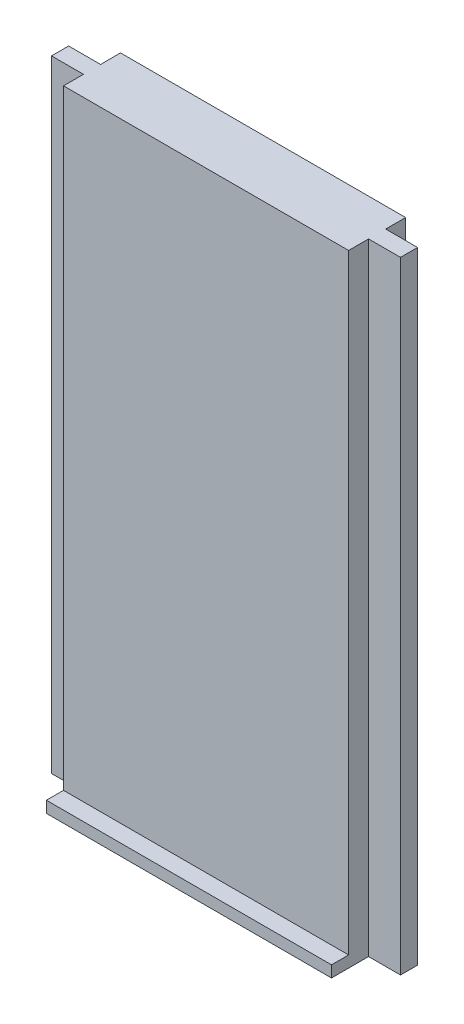
ISO-10303-21;
HEADER;
FILE_DESCRIPTION(('STEP AP214'),'2;1');
FILE_NAME('part.step','',(''),(''),'','','');
FILE_SCHEMA(('AUTOMOTIVE_DESIGN { 1 0 10303 214 1 1 1 1 }'));
ENDSEC;
DATA;
#1=APPLICATION_CONTEXT('core data for automotive mechanical design processes');
#2=APPLICATION_PROTOCOL_DEFINITION('international standard','automotive_design',2000,#1);
#3=PRODUCT_CONTEXT('',#1,'mechanical');
#4=PRODUCT('Part','Part','',(#3));
#5=PRODUCT_RELATED_PRODUCT_CATEGORY('part','',(#4));
#6=PRODUCT_DEFINITION_FORMATION('','',#4);
#7=PRODUCT_DEFINITION_CONTEXT('part definition',#1,'design');
#8=PRODUCT_DEFINITION('design','',#6,#7);
#9=PRODUCT_DEFINITION_SHAPE('','',#8);
#10=(LENGTH_UNIT() NAMED_UNIT(*) SI_UNIT(.MILLI.,.METRE.));
#11=(NAMED_UNIT(*) PLANE_ANGLE_UNIT() SI_UNIT($,.RADIAN.));
#12=(NAMED_UNIT(*) SI_UNIT($,.STERADIAN.) SOLID_ANGLE_UNIT());
#13=UNCERTAINTY_MEASURE_WITH_UNIT(LENGTH_MEASURE(1.E-05),#10,'distance_accuracy_value','');
#14=(GEOMETRIC_REPRESENTATION_CONTEXT(3) GLOBAL_UNCERTAINTY_ASSIGNED_CONTEXT((#13)) GLOBAL_UNIT_ASSIGNED_CONTEXT((#10,
#11,#12)) REPRESENTATION_CONTEXT('',''));
#15=CARTESIAN_POINT('',(0.,0.,0.));
#16=DIRECTION('',(0.,0.,1.));
#17=DIRECTION('',(1.,0.,0.));
#18=AXIS2_PLACEMENT_3D('',#15,#16,#17);
#19=CARTESIAN_POINT('',(-12.5,54.5,2.5));
#20=DIRECTION('',(0.,0.,-1.));
#21=DIRECTION('',(-1.,0.,0.));
#22=AXIS2_PLACEMENT_3D('',#19,#20,#21);
#23=PLANE('',#22);
#24=DIRECTION('',(-1.,0.,0.));
#25=VECTOR('',#24,1.);
#26=CARTESIAN_POINT('',(-12.5,1.,2.5));
#27=LINE('',#26,#25);
#28=CARTESIAN_POINT('',(12.5,1.,2.5));
#29=VERTEX_POINT('',#28);
#30=CARTESIAN_POINT('',(-12.5,1.,2.5));
#31=VERTEX_POINT('',#30);
#32=EDGE_CURVE('E50',#29,#31,#27,.T.);
#33=ORIENTED_EDGE('',*,*,#32,.F.);
#34=DIRECTION('',(0.,-1.,0.));
#35=VECTOR('',#34,1.);
#36=CARTESIAN_POINT('',(12.5,54.5,2.5));
#37=LINE('',#36,#35);
#38=CARTESIAN_POINT('',(12.5,54.5,2.5));
#39=VERTEX_POINT('',#38);
#40=EDGE_CURVE('E189',#39,#29,#37,.T.);
#41=ORIENTED_EDGE('',*,*,#40,.F.);
#42=DIRECTION('',(1.,0.,0.));
#43=VECTOR('',#42,1.);
#44=CARTESIAN_POINT('',(-12.5,54.5,2.5));
#45=LINE('',#44,#43);
#46=CARTESIAN_POINT('',(-12.5,54.5,2.5));
#47=VERTEX_POINT('',#46);
#48=EDGE_CURVE('E236',#47,#39,#45,.T.);
#49=ORIENTED_EDGE('',*,*,#48,.F.);
#50=DIRECTION('',(0.,-1.,0.));
#51=VECTOR('',#50,1.);
#52=CARTESIAN_POINT('',(-12.5,54.5,2.5));
#53=LINE('',#52,#51);
#54=EDGE_CURVE('E191',#47,#31,#53,.T.);
#55=ORIENTED_EDGE('',*,*,#54,.T.);
#56=EDGE_LOOP('',(#33,#41,#49,#55));
#57=FACE_BOUND('',#56,.T.);
#58=ADVANCED_FACE('F35',(#57),#23,.F.);
#59=CARTESIAN_POINT('',(12.5,54.5,-0.749999999999998));
#60=DIRECTION('',(-1.,0.,0.));
#61=DIRECTION('',(0.,0.,1.));
#62=AXIS2_PLACEMENT_3D('',#59,#60,#61);
#63=PLANE('',#62);
#64=DIRECTION('',(0.,0.,-1.));
#65=VECTOR('',#64,1.);
#66=CARTESIAN_POINT('',(12.5,0.,-0.749999999999998));
#67=LINE('',#66,#65);
#68=CARTESIAN_POINT('',(12.5,0.,-0.749999999999998));
#69=VERTEX_POINT('',#68);
#70=CARTESIAN_POINT('',(12.5,0.,-2.5));
#71=VERTEX_POINT('',#70);
#72=EDGE_CURVE('E162',#69,#71,#67,.T.);
#73=ORIENTED_EDGE('',*,*,#72,.T.);
#74=DIRECTION('',(0.,-1.,0.));
#75=VECTOR('',#74,1.);
#76=CARTESIAN_POINT('',(12.5,54.5,-2.5));
#77=LINE('',#76,#75);
#78=CARTESIAN_POINT('',(12.5,54.5,-2.5));
#79=VERTEX_POINT('',#78);
#80=EDGE_CURVE('E11',#79,#71,#77,.T.);
#81=ORIENTED_EDGE('',*,*,#80,.F.);
#82=DIRECTION('',(0.,0.,-1.));
#83=VECTOR('',#82,1.);
#84=CARTESIAN_POINT('',(12.5,54.5,-0.749999999999998));
#85=LINE('',#84,#83);
#86=CARTESIAN_POINT('',(12.5,54.5,-0.749999999999998));
#87=VERTEX_POINT('',#86);
#88=EDGE_CURVE('E185',#87,#79,#85,.T.);
#89=ORIENTED_EDGE('',*,*,#88,.F.);
#90=DIRECTION('',(0.,-1.,0.));
#91=VECTOR('',#90,1.);
#92=CARTESIAN_POINT('',(12.5,54.5,-0.749999999999998));
#93=LINE('',#92,#91);
#94=EDGE_CURVE('E158',#87,#69,#93,.T.);
#95=ORIENTED_EDGE('',*,*,#94,.T.);
#96=EDGE_LOOP('',(#73,#81,#89,#95));
#97=FACE_BOUND('',#96,.T.);
#98=ADVANCED_FACE('F37',(#97),#63,.F.);
#99=CARTESIAN_POINT('',(-12.5,54.5,-2.5));
#100=DIRECTION('',(0.,0.,1.));
#101=DIRECTION('',(1.,0.,0.));
#102=AXIS2_PLACEMENT_3D('',#99,#100,#101);
#103=PLANE('',#102);
#104=DIRECTION('',(-1.,0.,0.));
#105=VECTOR('',#104,1.);
#106=CARTESIAN_POINT('',(-12.5,0.,-2.5));
#107=LINE('',#106,#105);
#108=CARTESIAN_POINT('',(-12.5,0.,-2.5));
#109=VERTEX_POINT('',#108);
#110=EDGE_CURVE('E165',#71,#109,#107,.T.);
#111=ORIENTED_EDGE('',*,*,#110,.T.);
#112=DIRECTION('',(0.,-1.,0.));
#113=VECTOR('',#112,1.);
#114=CARTESIAN_POINT('',(-12.5,54.5,-2.5));
#115=LINE('',#114,#113);
#116=CARTESIAN_POINT('',(-12.5,54.5,-2.5));
#117=VERTEX_POINT('',#116);
#118=EDGE_CURVE('E43',#117,#109,#115,.T.);
#119=ORIENTED_EDGE('',*,*,#118,.F.);
#120=DIRECTION('',(-1.,0.,0.));
#121=VECTOR('',#120,1.);
#122=CARTESIAN_POINT('',(-12.5,54.5,-2.5));
#123=LINE('',#122,#121);
#124=EDGE_CURVE('E106',#79,#117,#123,.T.);
#125=ORIENTED_EDGE('',*,*,#124,.F.);
#126=ORIENTED_EDGE('',*,*,#80,.T.);
#127=EDGE_LOOP('',(#111,#119,#125,#126));
#128=FACE_BOUND('',#127,.T.);
#129=ADVANCED_FACE('F302',(#128),#103,.F.);
#130=CARTESIAN_POINT('',(-12.5,54.5,-0.749999999999998));
#131=DIRECTION('',(1.,0.,0.));
#132=DIRECTION('',(0.,0.,-1.));
#133=AXIS2_PLACEMENT_3D('',#130,#131,#132);
#134=PLANE('',#133);
#135=DIRECTION('',(0.,0.,1.));
#136=VECTOR('',#135,1.);
#137=CARTESIAN_POINT('',(-12.5,0.,-0.749999999999998));
#138=LINE('',#137,#136);
#139=CARTESIAN_POINT('',(-12.5,0.,-0.749999999999998));
#140=VERTEX_POINT('',#139);
#141=EDGE_CURVE('E168',#109,#140,#138,.T.);
#142=ORIENTED_EDGE('',*,*,#141,.T.);
#143=DIRECTION('',(0.,-1.,0.));
#144=VECTOR('',#143,1.);
#145=CARTESIAN_POINT('',(-12.5,54.5,-0.749999999999998));
#146=LINE('',#145,#144);
#147=CARTESIAN_POINT('',(-12.5,54.5,-0.749999999999998));
#148=VERTEX_POINT('',#147);
#149=EDGE_CURVE('E202',#148,#140,#146,.T.);
#150=ORIENTED_EDGE('',*,*,#149,.F.);
#151=DIRECTION('',(0.,0.,1.));
#152=VECTOR('',#151,1.);
#153=CARTESIAN_POINT('',(-12.5,54.5,-0.749999999999998));
#154=LINE('',#153,#152);
#155=EDGE_CURVE('E210',#117,#148,#154,.T.);
#156=ORIENTED_EDGE('',*,*,#155,.F.);
#157=ORIENTED_EDGE('',*,*,#118,.T.);
#158=EDGE_LOOP('',(#142,#150,#156,#157));
#159=FACE_BOUND('',#158,.T.);
#160=ADVANCED_FACE('F208',(#159),#134,.F.);
#161=CARTESIAN_POINT('',(-12.5,54.5,-0.749999999999998));
#162=DIRECTION('',(0.,0.,1.));
#163=DIRECTION('',(1.,0.,0.));
#164=AXIS2_PLACEMENT_3D('',#161,#162,#163);
#165=PLANE('',#164);
#166=DIRECTION('',(-1.,0.,0.));
#167=VECTOR('',#166,1.);
#168=CARTESIAN_POINT('',(-12.5,0.,-0.749999999999998));
#169=LINE('',#168,#167);
#170=CARTESIAN_POINT('',(-15.3,0.,-0.749999999999998));
#171=VERTEX_POINT('',#170);
#172=EDGE_CURVE('E170',#140,#171,#169,.T.);
#173=ORIENTED_EDGE('',*,*,#172,.T.);
#174=DIRECTION('',(0.,-1.,0.));
#175=VECTOR('',#174,1.);
#176=CARTESIAN_POINT('',(-15.3,54.5,-0.749999999999998));
#177=LINE('',#176,#175);
#178=CARTESIAN_POINT('',(-15.3,54.5,-0.749999999999998));
#179=VERTEX_POINT('',#178);
#180=EDGE_CURVE('E199',#179,#171,#177,.T.);
#181=ORIENTED_EDGE('',*,*,#180,.F.);
#182=DIRECTION('',(-1.,0.,0.));
#183=VECTOR('',#182,1.);
#184=CARTESIAN_POINT('',(-12.5,54.5,-0.749999999999998));
#185=LINE('',#184,#183);
#186=EDGE_CURVE('E228',#148,#179,#185,.T.);
#187=ORIENTED_EDGE('',*,*,#186,.F.);
#188=ORIENTED_EDGE('',*,*,#149,.T.);
#189=EDGE_LOOP('',(#173,#181,#187,#188));
#190=FACE_BOUND('',#189,.T.);
#191=ADVANCED_FACE('F219',(#190),#165,.F.);
#192=CARTESIAN_POINT('',(-15.3,54.5,0.750000000000003));
#193=DIRECTION('',(1.,0.,0.));
#194=DIRECTION('',(0.,0.,-1.));
#195=AXIS2_PLACEMENT_3D('',#192,#193,#194);
#196=PLANE('',#195);
#197=DIRECTION('',(0.,0.,1.));
#198=VECTOR('',#197,1.);
#199=CARTESIAN_POINT('',(-15.3,0.,0.750000000000003));
#200=LINE('',#199,#198);
#201=CARTESIAN_POINT('',(-15.3,0.,0.750000000000003));
#202=VERTEX_POINT('',#201);
#203=EDGE_CURVE('E172',#171,#202,#200,.T.);
#204=ORIENTED_EDGE('',*,*,#203,.T.);
#205=DIRECTION('',(0.,-1.,0.));
#206=VECTOR('',#205,1.);
#207=CARTESIAN_POINT('',(-15.3,54.5,0.750000000000003));
#208=LINE('',#207,#206);
#209=CARTESIAN_POINT('',(-15.3,54.5,0.750000000000003));
#210=VERTEX_POINT('',#209);
#211=EDGE_CURVE('E196',#210,#202,#208,.T.);
#212=ORIENTED_EDGE('',*,*,#211,.F.);
#213=DIRECTION('',(0.,0.,1.));
#214=VECTOR('',#213,1.);
#215=CARTESIAN_POINT('',(-15.3,54.5,0.750000000000003));
#216=LINE('',#215,#214);
#217=EDGE_CURVE('E225',#179,#210,#216,.T.);
#218=ORIENTED_EDGE('',*,*,#217,.F.);
#219=ORIENTED_EDGE('',*,*,#180,.T.);
#220=EDGE_LOOP('',(#204,#212,#218,#219));
#221=FACE_BOUND('',#220,.T.);
#222=ADVANCED_FACE('F223',(#221),#196,.F.);
#223=CARTESIAN_POINT('',(-12.5,54.5,0.750000000000002));
#224=DIRECTION('',(0.,0.,-1.));
#225=DIRECTION('',(-1.,0.,0.));
#226=AXIS2_PLACEMENT_3D('',#223,#224,#225);
#227=PLANE('',#226);
#228=DIRECTION('',(1.,0.,0.));
#229=VECTOR('',#228,1.);
#230=CARTESIAN_POINT('',(-12.5,0.,0.750000000000002));
#231=LINE('',#230,#229);
#232=CARTESIAN_POINT('',(-12.5,0.,0.750000000000002));
#233=VERTEX_POINT('',#232);
#234=EDGE_CURVE('E174',#202,#233,#231,.T.);
#235=ORIENTED_EDGE('',*,*,#234,.T.);
#236=DIRECTION('',(0.,-1.,0.));
#237=VECTOR('',#236,1.);
#238=CARTESIAN_POINT('',(-12.5,54.5,0.750000000000002));
#239=LINE('',#238,#237);
#240=CARTESIAN_POINT('',(-12.5,54.5,0.750000000000002));
#241=VERTEX_POINT('',#240);
#242=EDGE_CURVE('E193',#241,#233,#239,.T.);
#243=ORIENTED_EDGE('',*,*,#242,.F.);
#244=DIRECTION('',(1.,0.,0.));
#245=VECTOR('',#244,1.);
#246=CARTESIAN_POINT('',(-12.5,54.5,0.750000000000002));
#247=LINE('',#246,#245);
#248=EDGE_CURVE('E227',#210,#241,#247,.T.);
#249=ORIENTED_EDGE('',*,*,#248,.F.);
#250=ORIENTED_EDGE('',*,*,#211,.T.);
#251=EDGE_LOOP('',(#235,#243,#249,#250));
#252=FACE_BOUND('',#251,.T.);
#253=ADVANCED_FACE('F288',(#252),#227,.F.);
#254=CARTESIAN_POINT('',(-12.5,54.5,2.5));
#255=DIRECTION('',(1.,0.,0.));
#256=DIRECTION('',(0.,0.,-1.));
#257=AXIS2_PLACEMENT_3D('',#254,#255,#256);
#258=PLANE('',#257);
#259=DIRECTION('',(0.,0.,1.));
#260=VECTOR('',#259,1.);
#261=CARTESIAN_POINT('',(-12.5,0.,2.5));
#262=LINE('',#261,#260);
#263=CARTESIAN_POINT('',(-12.5,0.,4.));
#264=VERTEX_POINT('',#263);
#265=EDGE_CURVE('E176',#233,#264,#262,.T.);
#266=ORIENTED_EDGE('',*,*,#265,.T.);
#267=DIRECTION('',(0.,-1.,0.));
#268=VECTOR('',#267,1.);
#269=CARTESIAN_POINT('',(-12.5,1.,4.));
#270=LINE('',#269,#268);
#271=CARTESIAN_POINT('',(-12.5,1.,4.));
#272=VERTEX_POINT('',#271);
#273=EDGE_CURVE('E166',#272,#264,#270,.T.);
#274=ORIENTED_EDGE('',*,*,#273,.F.);
#275=DIRECTION('',(0.,0.,1.));
#276=VECTOR('',#275,1.);
#277=CARTESIAN_POINT('',(-12.5,1.,2.5));
#278=LINE('',#277,#276);
#279=EDGE_CURVE('E261',#31,#272,#278,.T.);
#280=ORIENTED_EDGE('',*,*,#279,.F.);
#281=ORIENTED_EDGE('',*,*,#54,.F.);
#282=DIRECTION('',(0.,0.,1.));
#283=VECTOR('',#282,1.);
#284=CARTESIAN_POINT('',(-12.5,54.5,2.5));
#285=LINE('',#284,#283);
#286=EDGE_CURVE('E230',#241,#47,#285,.T.);
#287=ORIENTED_EDGE('',*,*,#286,.F.);
#288=ORIENTED_EDGE('',*,*,#242,.T.);
#289=EDGE_LOOP('',(#266,#274,#280,#281,#287,#288));
#290=FACE_BOUND('',#289,.T.);
#291=ADVANCED_FACE('F279',(#290),#258,.F.);
#292=CARTESIAN_POINT('',(12.5,54.5,2.5));
#293=DIRECTION('',(-1.,0.,0.));
#294=DIRECTION('',(0.,0.,1.));
#295=AXIS2_PLACEMENT_3D('',#292,#293,#294);
#296=PLANE('',#295);
#297=DIRECTION('',(0.,0.,-1.));
#298=VECTOR('',#297,1.);
#299=CARTESIAN_POINT('',(12.5,0.,2.5));
#300=LINE('',#299,#298);
#301=CARTESIAN_POINT('',(12.5,0.,4.));
#302=VERTEX_POINT('',#301);
#303=CARTESIAN_POINT('',(12.5,0.,0.750000000000002));
#304=VERTEX_POINT('',#303);
#305=EDGE_CURVE('E179',#302,#304,#300,.T.);
#306=ORIENTED_EDGE('',*,*,#305,.T.);
#307=DIRECTION('',(0.,-1.,0.));
#308=VECTOR('',#307,1.);
#309=CARTESIAN_POINT('',(12.5,54.5,0.750000000000002));
#310=LINE('',#309,#308);
#311=CARTESIAN_POINT('',(12.5,54.5,0.750000000000002));
#312=VERTEX_POINT('',#311);
#313=EDGE_CURVE('E153',#312,#304,#310,.T.);
#314=ORIENTED_EDGE('',*,*,#313,.F.);
#315=DIRECTION('',(0.,0.,-1.));
#316=VECTOR('',#315,1.);
#317=CARTESIAN_POINT('',(12.5,54.5,2.5));
#318=LINE('',#317,#316);
#319=EDGE_CURVE('E141',#39,#312,#318,.T.);
#320=ORIENTED_EDGE('',*,*,#319,.F.);
#321=ORIENTED_EDGE('',*,*,#40,.T.);
#322=DIRECTION('',(0.,0.,-1.));
#323=VECTOR('',#322,1.);
#324=CARTESIAN_POINT('',(12.5,1.,2.5));
#325=LINE('',#324,#323);
#326=CARTESIAN_POINT('',(12.5,1.,4.));
#327=VERTEX_POINT('',#326);
#328=EDGE_CURVE('E263',#327,#29,#325,.T.);
#329=ORIENTED_EDGE('',*,*,#328,.F.);
#330=DIRECTION('',(0.,-1.,0.));
#331=VECTOR('',#330,1.);
#332=CARTESIAN_POINT('',(12.5,1.,4.));
#333=LINE('',#332,#331);
#334=EDGE_CURVE('E257',#327,#302,#333,.T.);
#335=ORIENTED_EDGE('',*,*,#334,.T.);
#336=EDGE_LOOP('',(#306,#314,#320,#321,#329,#335));
#337=FACE_BOUND('',#336,.T.);
#338=ADVANCED_FACE('F243',(#337),#296,.F.);
#339=CARTESIAN_POINT('',(12.5,54.5,0.750000000000002));
#340=DIRECTION('',(0.,0.,-1.));
#341=DIRECTION('',(-1.,0.,0.));
#342=AXIS2_PLACEMENT_3D('',#339,#340,#341);
#343=PLANE('',#342);
#344=DIRECTION('',(1.,0.,0.));
#345=VECTOR('',#344,1.);
#346=CARTESIAN_POINT('',(12.5,0.,0.750000000000002));
#347=LINE('',#346,#345);
#348=CARTESIAN_POINT('',(15.3,0.,0.750000000000003));
#349=VERTEX_POINT('',#348);
#350=EDGE_CURVE('E150',#304,#349,#347,.T.);
#351=ORIENTED_EDGE('',*,*,#350,.T.);
#352=DIRECTION('',(0.,-1.,0.));
#353=VECTOR('',#352,1.);
#354=CARTESIAN_POINT('',(15.3,54.5,0.750000000000003));
#355=LINE('',#354,#353);
#356=CARTESIAN_POINT('',(15.3,54.5,0.750000000000003));
#357=VERTEX_POINT('',#356);
#358=EDGE_CURVE('E147',#357,#349,#355,.T.);
#359=ORIENTED_EDGE('',*,*,#358,.F.);
#360=DIRECTION('',(1.,0.,0.));
#361=VECTOR('',#360,1.);
#362=CARTESIAN_POINT('',(12.5,54.5,0.750000000000002));
#363=LINE('',#362,#361);
#364=EDGE_CURVE('E134',#312,#357,#363,.T.);
#365=ORIENTED_EDGE('',*,*,#364,.F.);
#366=ORIENTED_EDGE('',*,*,#313,.T.);
#367=EDGE_LOOP('',(#351,#359,#365,#366));
#368=FACE_BOUND('',#367,.T.);
#369=ADVANCED_FACE('F148',(#368),#343,.F.);
#370=CARTESIAN_POINT('',(15.3,54.5,0.750000000000003));
#371=DIRECTION('',(-1.,0.,0.));
#372=DIRECTION('',(0.,0.,1.));
#373=AXIS2_PLACEMENT_3D('',#370,#371,#372);
#374=PLANE('',#373);
#375=DIRECTION('',(0.,0.,-1.));
#376=VECTOR('',#375,1.);
#377=CARTESIAN_POINT('',(15.3,0.,0.750000000000003));
#378=LINE('',#377,#376);
#379=CARTESIAN_POINT('',(15.3,0.,-0.749999999999998));
#380=VERTEX_POINT('',#379);
#381=EDGE_CURVE('E182',#349,#380,#378,.T.);
#382=ORIENTED_EDGE('',*,*,#381,.T.);
#383=DIRECTION('',(0.,-1.,0.));
#384=VECTOR('',#383,1.);
#385=CARTESIAN_POINT('',(15.3,54.5,-0.749999999999998));
#386=LINE('',#385,#384);
#387=CARTESIAN_POINT('',(15.3,54.5,-0.749999999999998));
#388=VERTEX_POINT('',#387);
#389=EDGE_CURVE('E154',#388,#380,#386,.T.);
#390=ORIENTED_EDGE('',*,*,#389,.F.);
#391=DIRECTION('',(0.,0.,-1.));
#392=VECTOR('',#391,1.);
#393=CARTESIAN_POINT('',(15.3,54.5,0.750000000000003));
#394=LINE('',#393,#392);
#395=EDGE_CURVE('E138',#357,#388,#394,.T.);
#396=ORIENTED_EDGE('',*,*,#395,.F.);
#397=ORIENTED_EDGE('',*,*,#358,.T.);
#398=EDGE_LOOP('',(#382,#390,#396,#397));
#399=FACE_BOUND('',#398,.T.);
#400=ADVANCED_FACE('F156',(#399),#374,.F.);
#401=CARTESIAN_POINT('',(12.5,54.5,-0.749999999999998));
#402=DIRECTION('',(0.,0.,1.));
#403=DIRECTION('',(1.,0.,0.));
#404=AXIS2_PLACEMENT_3D('',#401,#402,#403);
#405=PLANE('',#404);
#406=DIRECTION('',(-1.,0.,0.));
#407=VECTOR('',#406,1.);
#408=CARTESIAN_POINT('',(12.5,0.,-0.749999999999998));
#409=LINE('',#408,#407);
#410=EDGE_CURVE('E98',#380,#69,#409,.T.);
#411=ORIENTED_EDGE('',*,*,#410,.T.);
#412=ORIENTED_EDGE('',*,*,#94,.F.);
#413=DIRECTION('',(-1.,0.,0.));
#414=VECTOR('',#413,1.);
#415=CARTESIAN_POINT('',(12.5,54.5,-0.749999999999998));
#416=LINE('',#415,#414);
#417=EDGE_CURVE('E59',#388,#87,#416,.T.);
#418=ORIENTED_EDGE('',*,*,#417,.F.);
#419=ORIENTED_EDGE('',*,*,#389,.T.);
#420=EDGE_LOOP('',(#411,#412,#418,#419));
#421=FACE_BOUND('',#420,.T.);
#422=ADVANCED_FACE('F248',(#421),#405,.F.);
#423=CARTESIAN_POINT('',(0.,54.5,0.));
#424=DIRECTION('',(0.,-1.,0.));
#425=DIRECTION('',(0.,0.,-1.));
#426=AXIS2_PLACEMENT_3D('',#423,#424,#425);
#427=PLANE('',#426);
#428=ORIENTED_EDGE('',*,*,#88,.T.);
#429=ORIENTED_EDGE('',*,*,#124,.T.);
#430=ORIENTED_EDGE('',*,*,#155,.T.);
#431=ORIENTED_EDGE('',*,*,#186,.T.);
#432=ORIENTED_EDGE('',*,*,#217,.T.);
#433=ORIENTED_EDGE('',*,*,#248,.T.);
#434=ORIENTED_EDGE('',*,*,#286,.T.);
#435=ORIENTED_EDGE('',*,*,#48,.T.);
#436=ORIENTED_EDGE('',*,*,#319,.T.);
#437=ORIENTED_EDGE('',*,*,#364,.T.);
#438=ORIENTED_EDGE('',*,*,#395,.T.);
#439=ORIENTED_EDGE('',*,*,#417,.T.);
#440=EDGE_LOOP('',(#428,#429,#430,#431,#432,#433,#434,#435,#436,#437,#438,#439));
#441=FACE_BOUND('',#440,.T.);
#442=ADVANCED_FACE('F136',(#441),#427,.F.);
#443=CARTESIAN_POINT('',(0.,0.,0.));
#444=DIRECTION('',(0.,-1.,0.));
#445=DIRECTION('',(0.,0.,-1.));
#446=AXIS2_PLACEMENT_3D('',#443,#444,#445);
#447=PLANE('',#446);
#448=ORIENTED_EDGE('',*,*,#72,.F.);
#449=ORIENTED_EDGE('',*,*,#410,.F.);
#450=ORIENTED_EDGE('',*,*,#381,.F.);
#451=ORIENTED_EDGE('',*,*,#350,.F.);
#452=ORIENTED_EDGE('',*,*,#305,.F.);
#453=DIRECTION('',(1.,0.,0.));
#454=VECTOR('',#453,1.);
#455=CARTESIAN_POINT('',(-12.5,0.,4.));
#456=LINE('',#455,#454);
#457=EDGE_CURVE('E259',#264,#302,#456,.T.);
#458=ORIENTED_EDGE('',*,*,#457,.F.);
#459=ORIENTED_EDGE('',*,*,#265,.F.);
#460=ORIENTED_EDGE('',*,*,#234,.F.);
#461=ORIENTED_EDGE('',*,*,#203,.F.);
#462=ORIENTED_EDGE('',*,*,#172,.F.);
#463=ORIENTED_EDGE('',*,*,#141,.F.);
#464=ORIENTED_EDGE('',*,*,#110,.F.);
#465=EDGE_LOOP('',(#448,#449,#450,#451,#452,#458,#459,#460,#461,#462,#463,#464));
#466=FACE_BOUND('',#465,.T.);
#467=ADVANCED_FACE('F214',(#466),#447,.T.);
#468=CARTESIAN_POINT('',(-12.5,1.,4.));
#469=DIRECTION('',(0.,0.,-1.));
#470=DIRECTION('',(-1.,0.,0.));
#471=AXIS2_PLACEMENT_3D('',#468,#469,#470);
#472=PLANE('',#471);
#473=ORIENTED_EDGE('',*,*,#457,.T.);
#474=ORIENTED_EDGE('',*,*,#334,.F.);
#475=DIRECTION('',(1.,0.,0.));
#476=VECTOR('',#475,1.);
#477=CARTESIAN_POINT('',(-12.5,1.,4.));
#478=LINE('',#477,#476);
#479=EDGE_CURVE('E265',#272,#327,#478,.T.);
#480=ORIENTED_EDGE('',*,*,#479,.F.);
#481=ORIENTED_EDGE('',*,*,#273,.T.);
#482=EDGE_LOOP('',(#473,#474,#480,#481));
#483=FACE_BOUND('',#482,.T.);
#484=ADVANCED_FACE('F283',(#483),#472,.F.);
#485=CARTESIAN_POINT('',(0.,1.,0.));
#486=DIRECTION('',(0.,1.,0.));
#487=DIRECTION('',(0.,0.,1.));
#488=AXIS2_PLACEMENT_3D('',#485,#486,#487);
#489=PLANE('',#488);
#490=ORIENTED_EDGE('',*,*,#279,.T.);
#491=ORIENTED_EDGE('',*,*,#479,.T.);
#492=ORIENTED_EDGE('',*,*,#328,.T.);
#493=ORIENTED_EDGE('',*,*,#32,.T.);
#494=EDGE_LOOP('',(#490,#491,#492,#493));
#495=FACE_BOUND('',#494,.T.);
#496=ADVANCED_FACE('F273',(#495),#489,.T.);
#497=CLOSED_SHELL('',(#58,#98,#129,#160,#191,#222,#253,#291,#338,#369,#400,#422,#442,#467,#484,#496));
#498=MANIFOLD_SOLID_BREP('B2',#497);
#499=ADVANCED_BREP_SHAPE_REPRESENTATION('',(#18,#498),#14);
#500=SHAPE_DEFINITION_REPRESENTATION(#9,#499);
ENDSEC;
END-ISO-10303-21;
